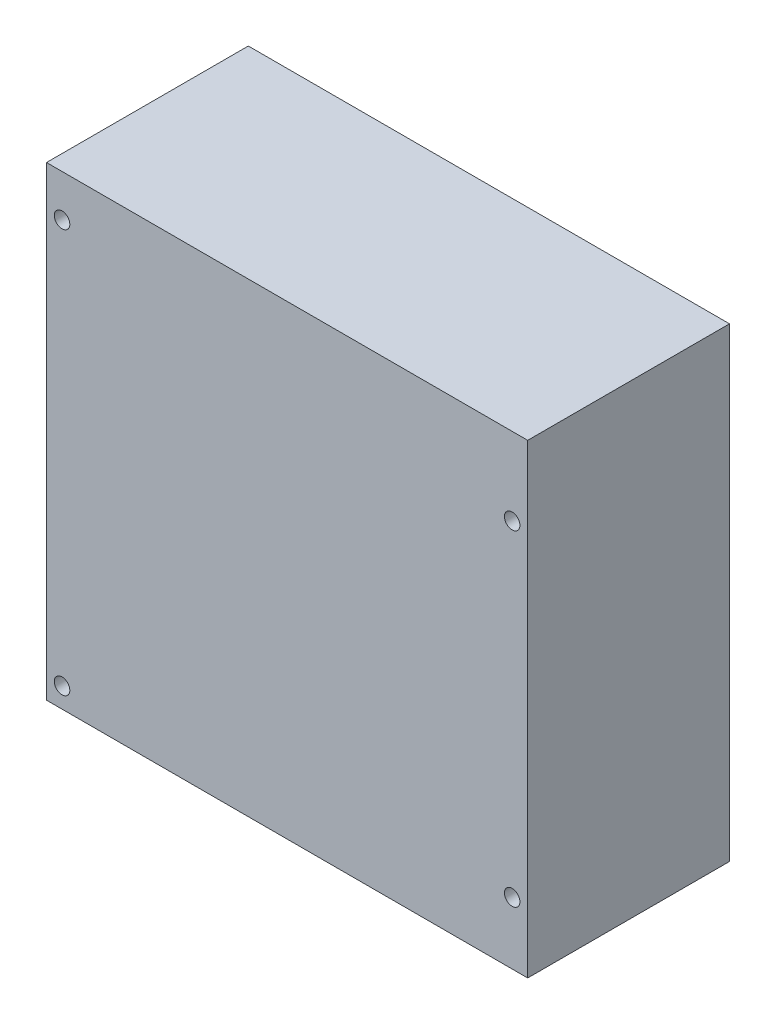
ISO-10303-21;
HEADER;
FILE_DESCRIPTION(('STEP AP214'),'2;1');
FILE_NAME('part.step','',(''),(''),'','','');
FILE_SCHEMA(('AUTOMOTIVE_DESIGN { 1 0 10303 214 1 1 1 1 }'));
ENDSEC;
DATA;
#1=APPLICATION_CONTEXT('core data for automotive mechanical design processes');
#2=APPLICATION_PROTOCOL_DEFINITION('international standard','automotive_design',2000,#1);
#3=PRODUCT_CONTEXT('',#1,'mechanical');
#4=PRODUCT('Part','Part','',(#3));
#5=PRODUCT_RELATED_PRODUCT_CATEGORY('part','',(#4));
#6=PRODUCT_DEFINITION_FORMATION('','',#4);
#7=PRODUCT_DEFINITION_CONTEXT('part definition',#1,'design');
#8=PRODUCT_DEFINITION('design','',#6,#7);
#9=PRODUCT_DEFINITION_SHAPE('','',#8);
#10=(LENGTH_UNIT() NAMED_UNIT(*) SI_UNIT(.MILLI.,.METRE.));
#11=(NAMED_UNIT(*) PLANE_ANGLE_UNIT() SI_UNIT($,.RADIAN.));
#12=(NAMED_UNIT(*) SI_UNIT($,.STERADIAN.) SOLID_ANGLE_UNIT());
#13=UNCERTAINTY_MEASURE_WITH_UNIT(LENGTH_MEASURE(1.E-05),#10,'distance_accuracy_value','');
#14=(GEOMETRIC_REPRESENTATION_CONTEXT(3) GLOBAL_UNCERTAINTY_ASSIGNED_CONTEXT((#13)) GLOBAL_UNIT_ASSIGNED_CONTEXT((#10,
#11,#12)) REPRESENTATION_CONTEXT('',''));
#15=CARTESIAN_POINT('',(0.,0.,0.));
#16=DIRECTION('',(0.,0.,1.));
#17=DIRECTION('',(1.,0.,0.));
#18=AXIS2_PLACEMENT_3D('',#15,#16,#17);
#19=CARTESIAN_POINT('',(36.83,-27.94,33.02));
#20=DIRECTION('',(0.,0.,-1.));
#21=DIRECTION('',(-1.,0.,0.));
#22=AXIS2_PLACEMENT_3D('',#19,#20,#21);
#23=CYLINDRICAL_SURFACE('',#22,1.27);
#24=CARTESIAN_POINT('',(36.83,-27.94,33.02));
#25=DIRECTION('',(0.,0.,1.));
#26=DIRECTION('',(1.,0.,0.));
#27=AXIS2_PLACEMENT_3D('',#24,#25,#26);
#28=CIRCLE('',#27,1.27);
#29=CARTESIAN_POINT('',(38.1,-27.94,33.02));
#30=VERTEX_POINT('',#29);
#31=EDGE_CURVE('E115',#30,#30,#28,.T.);
#32=ORIENTED_EDGE('',*,*,#31,.T.);
#33=EDGE_LOOP('',(#32));
#34=FACE_BOUND('',#33,.T.);
#35=CARTESIAN_POINT('',(36.83,-27.94,2.54));
#36=DIRECTION('',(0.,0.,-1.));
#37=DIRECTION('',(-1.,0.,0.));
#38=AXIS2_PLACEMENT_3D('',#35,#36,#37);
#39=CIRCLE('',#38,1.27);
#40=CARTESIAN_POINT('',(35.56,-27.94,2.54));
#41=VERTEX_POINT('',#40);
#42=EDGE_CURVE('E133',#41,#41,#39,.T.);
#43=ORIENTED_EDGE('',*,*,#42,.T.);
#44=EDGE_LOOP('',(#43));
#45=FACE_BOUND('',#44,.T.);
#46=ADVANCED_FACE('F34',(#34,#45),#23,.F.);
#47=CARTESIAN_POINT('',(-36.83,-34.798,33.02));
#48=DIRECTION('',(0.,0.,-1.));
#49=DIRECTION('',(-1.,0.,0.));
#50=AXIS2_PLACEMENT_3D('',#47,#48,#49);
#51=CYLINDRICAL_SURFACE('',#50,1.27);
#52=CARTESIAN_POINT('',(-36.83,-34.798,33.02));
#53=DIRECTION('',(0.,0.,1.));
#54=DIRECTION('',(1.,0.,0.));
#55=AXIS2_PLACEMENT_3D('',#52,#53,#54);
#56=CIRCLE('',#55,1.27);
#57=CARTESIAN_POINT('',(-35.56,-34.798,33.02));
#58=VERTEX_POINT('',#57);
#59=EDGE_CURVE('E121',#58,#58,#56,.T.);
#60=ORIENTED_EDGE('',*,*,#59,.T.);
#61=EDGE_LOOP('',(#60));
#62=FACE_BOUND('',#61,.T.);
#63=CARTESIAN_POINT('',(-36.83,-34.798,2.54));
#64=DIRECTION('',(0.,0.,-1.));
#65=DIRECTION('',(-1.,0.,0.));
#66=AXIS2_PLACEMENT_3D('',#63,#64,#65);
#67=CIRCLE('',#66,1.27);
#68=CARTESIAN_POINT('',(-38.1,-34.798,2.54));
#69=VERTEX_POINT('',#68);
#70=EDGE_CURVE('E130',#69,#69,#67,.T.);
#71=ORIENTED_EDGE('',*,*,#70,.T.);
#72=EDGE_LOOP('',(#71));
#73=FACE_BOUND('',#72,.T.);
#74=ADVANCED_FACE('F149',(#62,#73),#51,.F.);
#75=CARTESIAN_POINT('',(-36.83,31.242,33.02));
#76=DIRECTION('',(0.,0.,-1.));
#77=DIRECTION('',(-1.,0.,0.));
#78=AXIS2_PLACEMENT_3D('',#75,#76,#77);
#79=CYLINDRICAL_SURFACE('',#78,1.27);
#80=CARTESIAN_POINT('',(-36.83,31.242,33.02));
#81=DIRECTION('',(0.,0.,1.));
#82=DIRECTION('',(1.,0.,0.));
#83=AXIS2_PLACEMENT_3D('',#80,#81,#82);
#84=CIRCLE('',#83,1.27);
#85=CARTESIAN_POINT('',(-35.56,31.242,33.02));
#86=VERTEX_POINT('',#85);
#87=EDGE_CURVE('E118',#86,#86,#84,.T.);
#88=ORIENTED_EDGE('',*,*,#87,.T.);
#89=EDGE_LOOP('',(#88));
#90=FACE_BOUND('',#89,.T.);
#91=CARTESIAN_POINT('',(-36.83,31.242,2.54));
#92=DIRECTION('',(0.,0.,-1.));
#93=DIRECTION('',(-1.,0.,0.));
#94=AXIS2_PLACEMENT_3D('',#91,#92,#93);
#95=CIRCLE('',#94,1.27);
#96=CARTESIAN_POINT('',(-38.1,31.242,2.54));
#97=VERTEX_POINT('',#96);
#98=EDGE_CURVE('E127',#97,#97,#95,.T.);
#99=ORIENTED_EDGE('',*,*,#98,.T.);
#100=EDGE_LOOP('',(#99));
#101=FACE_BOUND('',#100,.T.);
#102=ADVANCED_FACE('F156',(#90,#101),#79,.F.);
#103=CARTESIAN_POINT('',(36.83,25.4,33.02));
#104=DIRECTION('',(0.,0.,-1.));
#105=DIRECTION('',(-1.,0.,0.));
#106=AXIS2_PLACEMENT_3D('',#103,#104,#105);
#107=CYLINDRICAL_SURFACE('',#106,1.27);
#108=CARTESIAN_POINT('',(36.83,25.4,33.02));
#109=DIRECTION('',(0.,0.,1.));
#110=DIRECTION('',(1.,0.,0.));
#111=AXIS2_PLACEMENT_3D('',#108,#109,#110);
#112=CIRCLE('',#111,1.27);
#113=CARTESIAN_POINT('',(38.1,25.4,33.02));
#114=VERTEX_POINT('',#113);
#115=EDGE_CURVE('E102',#114,#114,#112,.T.);
#116=ORIENTED_EDGE('',*,*,#115,.T.);
#117=EDGE_LOOP('',(#116));
#118=FACE_BOUND('',#117,.T.);
#119=CARTESIAN_POINT('',(36.83,25.4,2.54));
#120=DIRECTION('',(0.,0.,-1.));
#121=DIRECTION('',(-1.,0.,0.));
#122=AXIS2_PLACEMENT_3D('',#119,#120,#121);
#123=CIRCLE('',#122,1.27);
#124=CARTESIAN_POINT('',(35.56,25.4,2.54));
#125=VERTEX_POINT('',#124);
#126=EDGE_CURVE('E124',#125,#125,#123,.T.);
#127=ORIENTED_EDGE('',*,*,#126,.T.);
#128=EDGE_LOOP('',(#127));
#129=FACE_BOUND('',#128,.T.);
#130=ADVANCED_FACE('F161',(#118,#129),#107,.F.);
#131=CARTESIAN_POINT('',(39.37,38.1,33.02));
#132=DIRECTION('',(0.,0.,-1.));
#133=DIRECTION('',(-1.,0.,0.));
#134=AXIS2_PLACEMENT_3D('',#131,#132,#133);
#135=PLANE('',#134);
#136=ORIENTED_EDGE('',*,*,#87,.F.);
#137=EDGE_LOOP('',(#136));
#138=FACE_BOUND('',#137,.T.);
#139=ORIENTED_EDGE('',*,*,#115,.F.);
#140=EDGE_LOOP('',(#139));
#141=FACE_BOUND('',#140,.T.);
#142=DIRECTION('',(0.,1.,0.));
#143=VECTOR('',#142,1.);
#144=CARTESIAN_POINT('',(39.37,-38.1,33.02));
#145=LINE('',#144,#143);
#146=CARTESIAN_POINT('',(39.37,-38.1,33.02));
#147=VERTEX_POINT('',#146);
#148=CARTESIAN_POINT('',(39.37,38.1,33.02));
#149=VERTEX_POINT('',#148);
#150=EDGE_CURVE('E87',#147,#149,#145,.T.);
#151=ORIENTED_EDGE('',*,*,#150,.T.);
#152=DIRECTION('',(-1.,0.,0.));
#153=VECTOR('',#152,1.);
#154=CARTESIAN_POINT('',(-39.37,38.1,33.02));
#155=LINE('',#154,#153);
#156=CARTESIAN_POINT('',(-39.37,38.1,33.02));
#157=VERTEX_POINT('',#156);
#158=EDGE_CURVE('E81',#149,#157,#155,.T.);
#159=ORIENTED_EDGE('',*,*,#158,.T.);
#160=DIRECTION('',(0.,-1.,0.));
#161=VECTOR('',#160,1.);
#162=CARTESIAN_POINT('',(-39.37,-38.1,33.02));
#163=LINE('',#162,#161);
#164=CARTESIAN_POINT('',(-39.37,-38.1,33.02));
#165=VERTEX_POINT('',#164);
#166=EDGE_CURVE('E85',#157,#165,#163,.T.);
#167=ORIENTED_EDGE('',*,*,#166,.T.);
#168=DIRECTION('',(1.,0.,0.));
#169=VECTOR('',#168,1.);
#170=CARTESIAN_POINT('',(-39.37,-38.1,33.02));
#171=LINE('',#170,#169);
#172=EDGE_CURVE('E51',#165,#147,#171,.T.);
#173=ORIENTED_EDGE('',*,*,#172,.T.);
#174=EDGE_LOOP('',(#151,#159,#167,#173));
#175=FACE_BOUND('',#174,.T.);
#176=ORIENTED_EDGE('',*,*,#31,.F.);
#177=EDGE_LOOP('',(#176));
#178=FACE_BOUND('',#177,.T.);
#179=ORIENTED_EDGE('',*,*,#59,.F.);
#180=EDGE_LOOP('',(#179));
#181=FACE_BOUND('',#180,.T.);
#182=ADVANCED_FACE('F82',(#138,#141,#175,#178,#181),#135,.F.);
#183=CARTESIAN_POINT('',(39.37,38.1,0.));
#184=DIRECTION('',(0.,0.,-1.));
#185=DIRECTION('',(-1.,0.,0.));
#186=AXIS2_PLACEMENT_3D('',#183,#184,#185);
#187=PLANE('',#186);
#188=DIRECTION('',(0.,1.,0.));
#189=VECTOR('',#188,1.);
#190=CARTESIAN_POINT('',(39.37,-38.1,0.));
#191=LINE('',#190,#189);
#192=CARTESIAN_POINT('',(39.37,-38.1,0.));
#193=VERTEX_POINT('',#192);
#194=CARTESIAN_POINT('',(39.37,38.1,0.));
#195=VERTEX_POINT('',#194);
#196=EDGE_CURVE('E99',#193,#195,#191,.T.);
#197=ORIENTED_EDGE('',*,*,#196,.F.);
#198=DIRECTION('',(1.,0.,0.));
#199=VECTOR('',#198,1.);
#200=CARTESIAN_POINT('',(-39.37,-38.1,0.));
#201=LINE('',#200,#199);
#202=CARTESIAN_POINT('',(-39.37,-38.1,0.));
#203=VERTEX_POINT('',#202);
#204=EDGE_CURVE('E74',#203,#193,#201,.T.);
#205=ORIENTED_EDGE('',*,*,#204,.F.);
#206=DIRECTION('',(0.,-1.,0.));
#207=VECTOR('',#206,1.);
#208=CARTESIAN_POINT('',(-39.37,-38.1,0.));
#209=LINE('',#208,#207);
#210=CARTESIAN_POINT('',(-39.37,38.1,0.));
#211=VERTEX_POINT('',#210);
#212=EDGE_CURVE('E68',#211,#203,#209,.T.);
#213=ORIENTED_EDGE('',*,*,#212,.F.);
#214=DIRECTION('',(-1.,0.,0.));
#215=VECTOR('',#214,1.);
#216=CARTESIAN_POINT('',(-39.37,38.1,0.));
#217=LINE('',#216,#215);
#218=EDGE_CURVE('E91',#195,#211,#217,.T.);
#219=ORIENTED_EDGE('',*,*,#218,.F.);
#220=EDGE_LOOP('',(#197,#205,#213,#219));
#221=FACE_BOUND('',#220,.T.);
#222=ADVANCED_FACE('F110',(#221),#187,.T.);
#223=CARTESIAN_POINT('',(39.37,-38.1,33.02));
#224=DIRECTION('',(-1.,0.,0.));
#225=DIRECTION('',(0.,0.,1.));
#226=AXIS2_PLACEMENT_3D('',#223,#224,#225);
#227=PLANE('',#226);
#228=ORIENTED_EDGE('',*,*,#196,.T.);
#229=DIRECTION('',(0.,0.,-1.));
#230=VECTOR('',#229,1.);
#231=CARTESIAN_POINT('',(39.37,38.1,33.02));
#232=LINE('',#231,#230);
#233=EDGE_CURVE('E11',#149,#195,#232,.T.);
#234=ORIENTED_EDGE('',*,*,#233,.F.);
#235=ORIENTED_EDGE('',*,*,#150,.F.);
#236=DIRECTION('',(0.,0.,-1.));
#237=VECTOR('',#236,1.);
#238=CARTESIAN_POINT('',(39.37,-38.1,33.02));
#239=LINE('',#238,#237);
#240=EDGE_CURVE('E95',#147,#193,#239,.T.);
#241=ORIENTED_EDGE('',*,*,#240,.T.);
#242=EDGE_LOOP('',(#228,#234,#235,#241));
#243=FACE_BOUND('',#242,.T.);
#244=ADVANCED_FACE('F36',(#243),#227,.F.);
#245=CARTESIAN_POINT('',(-39.37,38.1,33.02));
#246=DIRECTION('',(0.,-1.,0.));
#247=DIRECTION('',(0.,0.,-1.));
#248=AXIS2_PLACEMENT_3D('',#245,#246,#247);
#249=PLANE('',#248);
#250=ORIENTED_EDGE('',*,*,#218,.T.);
#251=DIRECTION('',(0.,0.,-1.));
#252=VECTOR('',#251,1.);
#253=CARTESIAN_POINT('',(-39.37,38.1,33.02));
#254=LINE('',#253,#252);
#255=EDGE_CURVE('E43',#157,#211,#254,.T.);
#256=ORIENTED_EDGE('',*,*,#255,.F.);
#257=ORIENTED_EDGE('',*,*,#158,.F.);
#258=ORIENTED_EDGE('',*,*,#233,.T.);
#259=EDGE_LOOP('',(#250,#256,#257,#258));
#260=FACE_BOUND('',#259,.T.);
#261=ADVANCED_FACE('F90',(#260),#249,.F.);
#262=CARTESIAN_POINT('',(-39.37,-38.1,33.02));
#263=DIRECTION('',(1.,0.,0.));
#264=DIRECTION('',(0.,0.,-1.));
#265=AXIS2_PLACEMENT_3D('',#262,#263,#264);
#266=PLANE('',#265);
#267=ORIENTED_EDGE('',*,*,#212,.T.);
#268=DIRECTION('',(0.,0.,-1.));
#269=VECTOR('',#268,1.);
#270=CARTESIAN_POINT('',(-39.37,-38.1,33.02));
#271=LINE('',#270,#269);
#272=EDGE_CURVE('E92',#165,#203,#271,.T.);
#273=ORIENTED_EDGE('',*,*,#272,.F.);
#274=ORIENTED_EDGE('',*,*,#166,.F.);
#275=ORIENTED_EDGE('',*,*,#255,.T.);
#276=EDGE_LOOP('',(#267,#273,#274,#275));
#277=FACE_BOUND('',#276,.T.);
#278=ADVANCED_FACE('F93',(#277),#266,.F.);
#279=CARTESIAN_POINT('',(-39.37,-38.1,33.02));
#280=DIRECTION('',(0.,1.,0.));
#281=DIRECTION('',(0.,0.,1.));
#282=AXIS2_PLACEMENT_3D('',#279,#280,#281);
#283=PLANE('',#282);
#284=ORIENTED_EDGE('',*,*,#204,.T.);
#285=ORIENTED_EDGE('',*,*,#240,.F.);
#286=ORIENTED_EDGE('',*,*,#172,.F.);
#287=ORIENTED_EDGE('',*,*,#272,.T.);
#288=EDGE_LOOP('',(#284,#285,#286,#287));
#289=FACE_BOUND('',#288,.T.);
#290=ADVANCED_FACE('F107',(#289),#283,.F.);
#291=CARTESIAN_POINT('',(36.83,25.4,2.54));
#292=DIRECTION('',(0.,0.,-1.));
#293=DIRECTION('',(-1.,0.,0.));
#294=AXIS2_PLACEMENT_3D('',#291,#292,#293);
#295=PLANE('',#294);
#296=ORIENTED_EDGE('',*,*,#126,.F.);
#297=EDGE_LOOP('',(#296));
#298=FACE_BOUND('',#297,.T.);
#299=ADVANCED_FACE('F172',(#298),#295,.F.);
#300=CARTESIAN_POINT('',(-36.83,31.242,2.54));
#301=DIRECTION('',(0.,0.,-1.));
#302=DIRECTION('',(-1.,0.,0.));
#303=AXIS2_PLACEMENT_3D('',#300,#301,#302);
#304=PLANE('',#303);
#305=ORIENTED_EDGE('',*,*,#98,.F.);
#306=EDGE_LOOP('',(#305));
#307=FACE_BOUND('',#306,.T.);
#308=ADVANCED_FACE('F145',(#307),#304,.F.);
#309=CARTESIAN_POINT('',(-36.83,-34.798,2.54));
#310=DIRECTION('',(0.,0.,-1.));
#311=DIRECTION('',(-1.,0.,0.));
#312=AXIS2_PLACEMENT_3D('',#309,#310,#311);
#313=PLANE('',#312);
#314=ORIENTED_EDGE('',*,*,#70,.F.);
#315=EDGE_LOOP('',(#314));
#316=FACE_BOUND('',#315,.T.);
#317=ADVANCED_FACE('F140',(#316),#313,.F.);
#318=CARTESIAN_POINT('',(36.83,-27.94,2.54));
#319=DIRECTION('',(0.,0.,-1.));
#320=DIRECTION('',(-1.,0.,0.));
#321=AXIS2_PLACEMENT_3D('',#318,#319,#320);
#322=PLANE('',#321);
#323=ORIENTED_EDGE('',*,*,#42,.F.);
#324=EDGE_LOOP('',(#323));
#325=FACE_BOUND('',#324,.T.);
#326=ADVANCED_FACE('F138',(#325),#322,.F.);
#327=CLOSED_SHELL('',(#46,#74,#102,#130,#182,#222,#244,#261,#278,#290,#299,#308,#317,#326));
#328=MANIFOLD_SOLID_BREP('B2',#327);
#329=ADVANCED_BREP_SHAPE_REPRESENTATION('',(#18,#328),#14);
#330=SHAPE_DEFINITION_REPRESENTATION(#9,#329);
ENDSEC;
END-ISO-10303-21;
